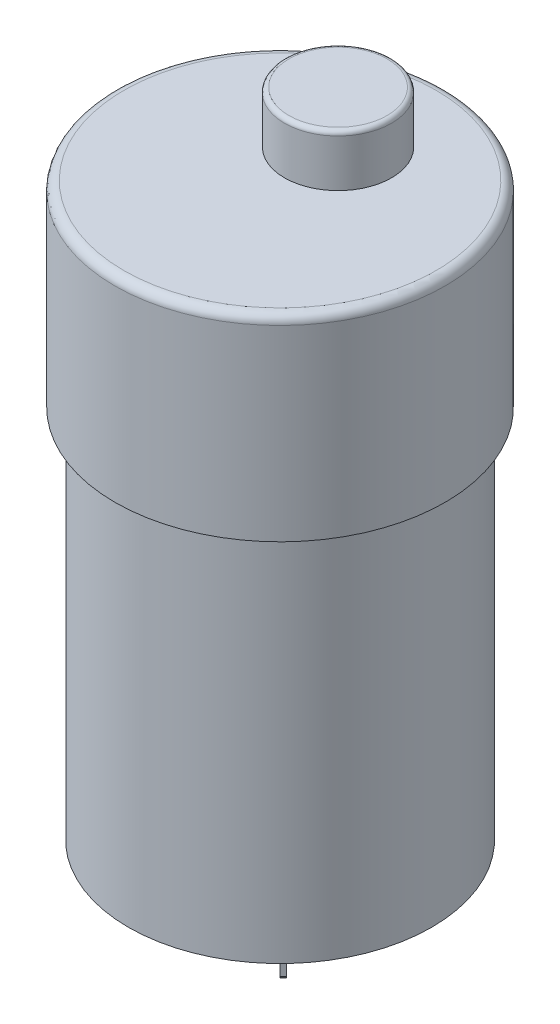
ISO-10303-21;
HEADER;
FILE_DESCRIPTION(('STEP AP214'),'2;1');
FILE_NAME('part.step','',(''),(''),'','','');
FILE_SCHEMA(('AUTOMOTIVE_DESIGN { 1 0 10303 214 1 1 1 1 }'));
ENDSEC;
DATA;
#1=APPLICATION_CONTEXT('core data for automotive mechanical design processes');
#2=APPLICATION_PROTOCOL_DEFINITION('international standard','automotive_design',2000,#1);
#3=PRODUCT_CONTEXT('',#1,'mechanical');
#4=PRODUCT('Part','Part','',(#3));
#5=PRODUCT_RELATED_PRODUCT_CATEGORY('part','',(#4));
#6=PRODUCT_DEFINITION_FORMATION('','',#4);
#7=PRODUCT_DEFINITION_CONTEXT('part definition',#1,'design');
#8=PRODUCT_DEFINITION('design','',#6,#7);
#9=PRODUCT_DEFINITION_SHAPE('','',#8);
#10=(LENGTH_UNIT() NAMED_UNIT(*) SI_UNIT(.MILLI.,.METRE.));
#11=(NAMED_UNIT(*) PLANE_ANGLE_UNIT() SI_UNIT($,.RADIAN.));
#12=(NAMED_UNIT(*) SI_UNIT($,.STERADIAN.) SOLID_ANGLE_UNIT());
#13=UNCERTAINTY_MEASURE_WITH_UNIT(LENGTH_MEASURE(1.E-05),#10,'distance_accuracy_value','');
#14=(GEOMETRIC_REPRESENTATION_CONTEXT(3) GLOBAL_UNCERTAINTY_ASSIGNED_CONTEXT((#13)) GLOBAL_UNIT_ASSIGNED_CONTEXT((#10,
#11,#12)) REPRESENTATION_CONTEXT('',''));
#15=CARTESIAN_POINT('',(0.,0.,0.));
#16=DIRECTION('',(0.,0.,1.));
#17=DIRECTION('',(1.,0.,0.));
#18=AXIS2_PLACEMENT_3D('',#15,#16,#17);
#19=CARTESIAN_POINT('',(0.,-44.5,0.));
#20=DIRECTION('',(0.,-1.,0.));
#21=DIRECTION('',(0.,0.,-1.));
#22=AXIS2_PLACEMENT_3D('',#19,#20,#21);
#23=PLANE('',#22);
#24=CARTESIAN_POINT('',(0.,-44.5000000020173,0.));
#25=DIRECTION('',(0.,1.,0.));
#26=DIRECTION('',(0.,0.,1.));
#27=AXIS2_PLACEMENT_3D('',#24,#25,#26);
#28=CIRCLE('',#27,1.99999999796319);
#29=CARTESIAN_POINT('',(0.,-44.5000000020173,1.99999999796319));
#30=VERTEX_POINT('',#29);
#31=EDGE_CURVE('E195',#30,#30,#28,.T.);
#32=ORIENTED_EDGE('',*,*,#31,.F.);
#33=EDGE_LOOP('',(#32));
#34=FACE_BOUND('',#33,.T.);
#35=ADVANCED_FACE('F15',(#34),#23,.T.);
#36=CARTESIAN_POINT('',(0.,-43.500000002382,0.));
#37=DIRECTION('',(0.,1.,0.));
#38=DIRECTION('',(0.,0.,1.));
#39=AXIS2_PLACEMENT_3D('',#36,#37,#38);
#40=CONICAL_SURFACE('',#39,2.99999999765532,0.78539816342587);
#41=CARTESIAN_POINT('',(0.,-43.5,0.));
#42=DIRECTION('',(0.,-1.,0.));
#43=DIRECTION('',(0.,0.,-1.));
#44=AXIS2_PLACEMENT_3D('',#41,#42,#43);
#45=CIRCLE('',#44,3.);
#46=CARTESIAN_POINT('',(0.,-43.5,-3.));
#47=VERTEX_POINT('',#46);
#48=EDGE_CURVE('E103',#47,#47,#45,.F.);
#49=ORIENTED_EDGE('',*,*,#48,.F.);
#50=EDGE_LOOP('',(#49));
#51=FACE_BOUND('',#50,.T.);
#52=ORIENTED_EDGE('',*,*,#31,.T.);
#53=EDGE_LOOP('',(#52));
#54=FACE_BOUND('',#53,.T.);
#55=ADVANCED_FACE('F636',(#51,#54),#40,.T.);
#56=CARTESIAN_POINT('',(0.,27.8,0.));
#57=DIRECTION('',(0.,1.,0.));
#58=DIRECTION('',(0.,0.,1.));
#59=AXIS2_PLACEMENT_3D('',#56,#57,#58);
#60=PLANE('',#59);
#61=CARTESIAN_POINT('',(0.,27.8,-6.5));
#62=DIRECTION('',(0.,-1.,0.));
#63=DIRECTION('',(1.,0.,0.));
#64=AXIS2_PLACEMENT_3D('',#61,#62,#63);
#65=CIRCLE('',#64,5.5);
#66=CARTESIAN_POINT('',(5.49999999999999,27.8,-6.49999999990358));
#67=VERTEX_POINT('',#66);
#68=CARTESIAN_POINT('',(-5.49999999999999,27.8,-6.50000000019283));
#69=VERTEX_POINT('',#68);
#70=EDGE_CURVE('E96',#67,#69,#65,.T.);
#71=ORIENTED_EDGE('',*,*,#70,.F.);
#72=CARTESIAN_POINT('',(0.,27.8,-6.5));
#73=DIRECTION('',(0.,-1.,0.));
#74=DIRECTION('',(-1.,0.,-8.7651950092022E-11));
#75=AXIS2_PLACEMENT_3D('',#72,#73,#74);
#76=CIRCLE('',#75,5.49999999999999);
#77=EDGE_CURVE('E101',#69,#67,#76,.T.);
#78=ORIENTED_EDGE('',*,*,#77,.F.);
#79=EDGE_LOOP('',(#71,#78));
#80=FACE_BOUND('',#79,.T.);
#81=ADVANCED_FACE('F100',(#80),#60,.T.);
#82=CARTESIAN_POINT('',(0.,-41.,0.));
#83=DIRECTION('',(0.,-1.,0.));
#84=DIRECTION('',(0.,0.,-1.));
#85=AXIS2_PLACEMENT_3D('',#82,#83,#84);
#86=CYLINDRICAL_SURFACE('',#85,3.);
#87=CARTESIAN_POINT('',(0.,-42.,0.));
#88=DIRECTION('',(0.,-1.,0.));
#89=DIRECTION('',(0.,0.,-1.));
#90=AXIS2_PLACEMENT_3D('',#87,#88,#89);
#91=CIRCLE('',#90,3.);
#92=CARTESIAN_POINT('',(0.,-42.,-3.));
#93=VERTEX_POINT('',#92);
#94=EDGE_CURVE('E108',#93,#93,#91,.T.);
#95=ORIENTED_EDGE('',*,*,#94,.T.);
#96=EDGE_LOOP('',(#95));
#97=FACE_BOUND('',#96,.T.);
#98=ORIENTED_EDGE('',*,*,#48,.T.);
#99=EDGE_LOOP('',(#98));
#100=FACE_BOUND('',#99,.T.);
#101=ADVANCED_FACE('F128',(#97,#100),#86,.T.);
#102=CARTESIAN_POINT('',(0.,27.3,-6.5));
#103=DIRECTION('',(0.,1.,0.));
#104=DIRECTION('',(0.99973125882797,0.,0.0231821078041371));
#105=AXIS2_PLACEMENT_3D('',#102,#103,#104);
#106=TOROIDAL_SURFACE('',#105,5.5,0.5);
#107=CARTESIAN_POINT('',(0.,27.3,-6.5));
#108=DIRECTION('',(0.,1.,0.));
#109=DIRECTION('',(0.,0.,1.));
#110=AXIS2_PLACEMENT_3D('',#107,#108,#109);
#111=CIRCLE('',#110,6.);
#112=CARTESIAN_POINT('',(0.,27.3,-0.5));
#113=VERTEX_POINT('',#112);
#114=EDGE_CURVE('E136',#113,#113,#111,.F.);
#115=ORIENTED_EDGE('',*,*,#114,.F.);
#116=EDGE_LOOP('',(#115));
#117=FACE_BOUND('',#116,.T.);
#118=ORIENTED_EDGE('',*,*,#77,.T.);
#119=ORIENTED_EDGE('',*,*,#70,.T.);
#120=EDGE_LOOP('',(#118,#119));
#121=FACE_BOUND('',#120,.T.);
#122=ADVANCED_FACE('F107',(#117,#121),#106,.T.);
#123=CARTESIAN_POINT('',(0.,-42.,0.));
#124=DIRECTION('',(0.,1.,0.));
#125=DIRECTION('',(0.,0.,1.));
#126=AXIS2_PLACEMENT_3D('',#123,#124,#125);
#127=PLANE('',#126);
#128=ORIENTED_EDGE('',*,*,#94,.F.);
#129=EDGE_LOOP('',(#128));
#130=FACE_BOUND('',#129,.T.);
#131=CARTESIAN_POINT('',(0.,-42.,0.));
#132=DIRECTION('',(0.,-1.,0.));
#133=DIRECTION('',(0.,0.,-1.));
#134=AXIS2_PLACEMENT_3D('',#131,#132,#133);
#135=CIRCLE('',#134,5.);
#136=CARTESIAN_POINT('',(0.,-42.,-5.));
#137=VERTEX_POINT('',#136);
#138=EDGE_CURVE('E138',#137,#137,#135,.F.);
#139=ORIENTED_EDGE('',*,*,#138,.F.);
#140=EDGE_LOOP('',(#139));
#141=FACE_BOUND('',#140,.T.);
#142=ADVANCED_FACE('F127',(#130,#141),#127,.F.);
#143=CARTESIAN_POINT('',(9.41866232540481,-41.,-10.1257691065914));
#144=DIRECTION('',(0.707106781186548,0.,-0.707106781186548));
#145=DIRECTION('',(-0.707106781186548,0.,-0.707106781186548));
#146=AXIS2_PLACEMENT_3D('',#143,#144,#145);
#147=PLANE('',#146);
#148=DIRECTION('',(0.,1.,0.));
#149=VECTOR('',#148,1.);
#150=CARTESIAN_POINT('',(9.77221571599809,-41.,-9.77221571599809));
#151=LINE('',#150,#149);
#152=CARTESIAN_POINT('',(9.77221571599809,-45.5,-9.77221571599809));
#153=VERTEX_POINT('',#152);
#154=CARTESIAN_POINT('',(9.77221571599809,-41.,-9.77221571599809));
#155=VERTEX_POINT('',#154);
#156=EDGE_CURVE('E319',#153,#155,#151,.T.);
#157=ORIENTED_EDGE('',*,*,#156,.F.);
#158=DIRECTION('',(0.707106781186554,0.,0.70710678118654));
#159=VECTOR('',#158,1.);
#160=CARTESIAN_POINT('',(9.41866232540481,-45.5,-10.1257691065914));
#161=LINE('',#160,#159);
#162=CARTESIAN_POINT('',(9.41866232540481,-45.5,-10.1257691065914));
#163=VERTEX_POINT('',#162);
#164=EDGE_CURVE('E167',#163,#153,#161,.T.);
#165=ORIENTED_EDGE('',*,*,#164,.F.);
#166=DIRECTION('',(0.,1.,0.));
#167=VECTOR('',#166,1.);
#168=CARTESIAN_POINT('',(9.41866232540481,-41.,-10.1257691065914));
#169=LINE('',#168,#167);
#170=CARTESIAN_POINT('',(9.41866232540481,-41.,-10.1257691065914));
#171=VERTEX_POINT('',#170);
#172=EDGE_CURVE('E325',#171,#163,#169,.F.);
#173=ORIENTED_EDGE('',*,*,#172,.F.);
#174=DIRECTION('',(-0.707106781186548,0.,-0.707106781186548));
#175=VECTOR('',#174,1.);
#176=CARTESIAN_POINT('',(9.41866232540481,-41.,-10.1257691065914));
#177=LINE('',#176,#175);
#178=EDGE_CURVE('E134',#171,#155,#177,.F.);
#179=ORIENTED_EDGE('',*,*,#178,.T.);
#180=EDGE_LOOP('',(#157,#165,#173,#179));
#181=FACE_BOUND('',#180,.T.);
#182=ADVANCED_FACE('F354',(#181),#147,.T.);
#183=CARTESIAN_POINT('',(8.00444876303172,-41.,-8.00444876303172));
#184=DIRECTION('',(-0.707106781186547,0.,0.707106781186548));
#185=DIRECTION('',(0.707106781186548,0.,0.707106781186547));
#186=AXIS2_PLACEMENT_3D('',#183,#184,#185);
#187=PLANE('',#186);
#188=DIRECTION('',(0.,1.,0.));
#189=VECTOR('',#188,1.);
#190=CARTESIAN_POINT('',(7.65089537243844,-41.,-8.35800215362499));
#191=LINE('',#190,#189);
#192=CARTESIAN_POINT('',(7.65089537243844,-45.5,-8.35800215362499));
#193=VERTEX_POINT('',#192);
#194=CARTESIAN_POINT('',(7.65089537243844,-41.,-8.35800215362499));
#195=VERTEX_POINT('',#194);
#196=EDGE_CURVE('E328',#193,#195,#191,.T.);
#197=ORIENTED_EDGE('',*,*,#196,.F.);
#198=DIRECTION('',(-0.707106781186549,0.,-0.707106781186546));
#199=VECTOR('',#198,1.);
#200=CARTESIAN_POINT('',(8.00444876303172,-45.5,-8.00444876303172));
#201=LINE('',#200,#199);
#202=CARTESIAN_POINT('',(8.00444876303172,-45.5,-8.00444876303172));
#203=VERTEX_POINT('',#202);
#204=EDGE_CURVE('E175',#203,#193,#201,.T.);
#205=ORIENTED_EDGE('',*,*,#204,.F.);
#206=DIRECTION('',(0.,1.,0.));
#207=VECTOR('',#206,1.);
#208=CARTESIAN_POINT('',(8.00444876303172,-41.,-8.00444876303172));
#209=LINE('',#208,#207);
#210=CARTESIAN_POINT('',(8.00444876303172,-41.,-8.00444876303172));
#211=VERTEX_POINT('',#210);
#212=EDGE_CURVE('E316',#211,#203,#209,.F.);
#213=ORIENTED_EDGE('',*,*,#212,.F.);
#214=DIRECTION('',(0.707106781186548,0.,0.707106781186547));
#215=VECTOR('',#214,1.);
#216=CARTESIAN_POINT('',(8.00444876303172,-41.,-8.00444876303172));
#217=LINE('',#216,#215);
#218=EDGE_CURVE('E176',#211,#195,#217,.F.);
#219=ORIENTED_EDGE('',*,*,#218,.T.);
#220=EDGE_LOOP('',(#197,#205,#213,#219));
#221=FACE_BOUND('',#220,.T.);
#222=ADVANCED_FACE('F348',(#221),#187,.T.);
#223=CARTESIAN_POINT('',(8.00444876303172,-45.75,-8.35800215362499));
#224=DIRECTION('',(-0.499999999999998,-0.70710678118655,0.499999999999999));
#225=DIRECTION('',(0.,-0.577350269189624,-0.816496580927728));
#226=AXIS2_PLACEMENT_3D('',#223,#224,#225);
#227=PLANE('',#226);
#228=ORIENTED_EDGE('',*,*,#204,.T.);
#229=DIRECTION('',(-0.499999999999999,0.707106781186548,0.5));
#230=VECTOR('',#229,1.);
#231=CARTESIAN_POINT('',(8.00444876303172,-46.,-8.71155554421827));
#232=LINE('',#231,#230);
#233=CARTESIAN_POINT('',(8.00444876303172,-46.,-8.71155554421827));
#234=VERTEX_POINT('',#233);
#235=EDGE_CURVE('E329',#234,#193,#232,.T.);
#236=ORIENTED_EDGE('',*,*,#235,.F.);
#237=DIRECTION('',(-0.707106781186546,0.,-0.707106781186549));
#238=VECTOR('',#237,1.);
#239=CARTESIAN_POINT('',(8.35800215362499,-46.,-8.35800215362499));
#240=LINE('',#239,#238);
#241=CARTESIAN_POINT('',(8.35800215362499,-46.,-8.35800215362499));
#242=VERTEX_POINT('',#241);
#243=EDGE_CURVE('E173',#242,#234,#240,.T.);
#244=ORIENTED_EDGE('',*,*,#243,.F.);
#245=DIRECTION('',(0.499999999999999,-0.707106781186549,-0.499999999999999));
#246=VECTOR('',#245,1.);
#247=CARTESIAN_POINT('',(8.00444876303172,-45.5,-8.00444876303172));
#248=LINE('',#247,#246);
#249=EDGE_CURVE('E313',#203,#242,#248,.T.);
#250=ORIENTED_EDGE('',*,*,#249,.F.);
#251=EDGE_LOOP('',(#228,#236,#244,#250));
#252=FACE_BOUND('',#251,.T.);
#253=ADVANCED_FACE('F347',(#252),#227,.T.);
#254=CARTESIAN_POINT('',(0.,-46.,0.));
#255=DIRECTION('',(0.,-1.,0.));
#256=DIRECTION('',(0.,0.,-1.));
#257=AXIS2_PLACEMENT_3D('',#254,#255,#256);
#258=PLANE('',#257);
#259=DIRECTION('',(-0.707106781186548,0.,0.707106781186547));
#260=VECTOR('',#259,1.);
#261=CARTESIAN_POINT('',(7.65089537243844,-46.,-8.35800215362499));
#262=LINE('',#261,#260);
#263=CARTESIAN_POINT('',(9.06510893481154,-46.,-9.77221571599809));
#264=VERTEX_POINT('',#263);
#265=EDGE_CURVE('E143',#264,#234,#262,.T.);
#266=ORIENTED_EDGE('',*,*,#265,.F.);
#267=DIRECTION('',(-0.707106781186546,0.,-0.707106781186549));
#268=VECTOR('',#267,1.);
#269=CARTESIAN_POINT('',(9.41866232540481,-46.,-9.41866232540481));
#270=LINE('',#269,#268);
#271=CARTESIAN_POINT('',(9.41866232540481,-46.,-9.41866232540481));
#272=VERTEX_POINT('',#271);
#273=EDGE_CURVE('E170',#272,#264,#270,.T.);
#274=ORIENTED_EDGE('',*,*,#273,.F.);
#275=DIRECTION('',(0.707106781186548,0.,-0.707106781186548));
#276=VECTOR('',#275,1.);
#277=CARTESIAN_POINT('',(9.77221571599809,-46.,-9.77221571599809));
#278=LINE('',#277,#276);
#279=EDGE_CURVE('E310',#242,#272,#278,.T.);
#280=ORIENTED_EDGE('',*,*,#279,.F.);
#281=ORIENTED_EDGE('',*,*,#243,.T.);
#282=EDGE_LOOP('',(#266,#274,#280,#281));
#283=FACE_BOUND('',#282,.T.);
#284=ADVANCED_FACE('F337',(#283),#258,.T.);
#285=CARTESIAN_POINT('',(9.41866232540484,-45.75,-9.77221571599806));
#286=DIRECTION('',(0.499999999999998,-0.70710678118655,-0.499999999999998));
#287=DIRECTION('',(0.,0.577350269189623,-0.816496580927728));
#288=AXIS2_PLACEMENT_3D('',#285,#286,#287);
#289=PLANE('',#288);
#290=ORIENTED_EDGE('',*,*,#164,.T.);
#291=DIRECTION('',(0.499999999999999,0.707106781186549,-0.499999999999999));
#292=VECTOR('',#291,1.);
#293=CARTESIAN_POINT('',(9.41866232540481,-46.,-9.41866232540482));
#294=LINE('',#293,#292);
#295=EDGE_CURVE('E307',#272,#153,#294,.T.);
#296=ORIENTED_EDGE('',*,*,#295,.F.);
#297=ORIENTED_EDGE('',*,*,#273,.T.);
#298=DIRECTION('',(-0.5,-0.707106781186546,0.500000000000002));
#299=VECTOR('',#298,1.);
#300=CARTESIAN_POINT('',(9.41866232540481,-45.5,-10.1257691065914));
#301=LINE('',#300,#299);
#302=EDGE_CURVE('E322',#163,#264,#301,.T.);
#303=ORIENTED_EDGE('',*,*,#302,.F.);
#304=EDGE_LOOP('',(#290,#296,#297,#303));
#305=FACE_BOUND('',#304,.T.);
#306=ADVANCED_FACE('F341',(#305),#289,.T.);
#307=CARTESIAN_POINT('',(8.53477884892163,-45.,-9.24188563010818));
#308=DIRECTION('',(-0.707106781186547,0.,-0.707106781186548));
#309=DIRECTION('',(-0.707106781186548,0.,0.707106781186547));
#310=AXIS2_PLACEMENT_3D('',#307,#308,#309);
#311=CYLINDRICAL_SURFACE('',#310,0.5);
#312=CARTESIAN_POINT('',(8.53477884892163,-45.,-9.24188563010818));
#313=DIRECTION('',(-0.707106781186547,0.,-0.707106781186548));
#314=DIRECTION('',(-0.707106781186548,0.,0.707106781186547));
#315=AXIS2_PLACEMENT_3D('',#312,#313,#314);
#316=CIRCLE('',#315,0.5);
#317=CARTESIAN_POINT('',(8.18122545832835,-45.,-8.8883322395149));
#318=VERTEX_POINT('',#317);
#319=EDGE_CURVE('E321',#318,#318,#316,.F.);
#320=ORIENTED_EDGE('',*,*,#319,.F.);
#321=EDGE_LOOP('',(#320));
#322=FACE_BOUND('',#321,.T.);
#323=CARTESIAN_POINT('',(8.88833223951491,-45.,-8.8883322395149));
#324=DIRECTION('',(-0.707106781186547,0.,-0.707106781186548));
#325=DIRECTION('',(-0.707106781186548,0.,0.707106781186547));
#326=AXIS2_PLACEMENT_3D('',#323,#324,#325);
#327=CIRCLE('',#326,0.5);
#328=CARTESIAN_POINT('',(8.53477884892163,-45.,-8.53477884892163));
#329=VERTEX_POINT('',#328);
#330=EDGE_CURVE('E306',#329,#329,#327,.T.);
#331=ORIENTED_EDGE('',*,*,#330,.F.);
#332=EDGE_LOOP('',(#331));
#333=FACE_BOUND('',#332,.T.);
#334=ADVANCED_FACE('F394',(#322,#333),#311,.F.);
#335=CARTESIAN_POINT('',(0.,-46.,0.));
#336=DIRECTION('',(0.,-1.,0.));
#337=DIRECTION('',(0.,0.,-1.));
#338=AXIS2_PLACEMENT_3D('',#335,#336,#337);
#339=PLANE('',#338);
#340=DIRECTION('',(0.707106781186548,0.,0.707106781186547));
#341=VECTOR('',#340,1.);
#342=CARTESIAN_POINT('',(9.77221571599809,-46.,9.77221571599809));
#343=LINE('',#342,#341);
#344=CARTESIAN_POINT('',(8.35800215362499,-46.,8.35800215362499));
#345=VERTEX_POINT('',#344);
#346=CARTESIAN_POINT('',(9.41866232540482,-46.,9.41866232540482));
#347=VERTEX_POINT('',#346);
#348=EDGE_CURVE('E288',#345,#347,#343,.T.);
#349=ORIENTED_EDGE('',*,*,#348,.F.);
#350=DIRECTION('',(-0.707106781186549,0.,0.707106781186546));
#351=VECTOR('',#350,1.);
#352=CARTESIAN_POINT('',(8.71155554421827,-46.,8.00444876303172));
#353=LINE('',#352,#351);
#354=CARTESIAN_POINT('',(8.71155554421827,-46.,8.00444876303172));
#355=VERTEX_POINT('',#354);
#356=EDGE_CURVE('E146',#355,#345,#353,.T.);
#357=ORIENTED_EDGE('',*,*,#356,.F.);
#358=DIRECTION('',(-0.707106781186548,0.,-0.707106781186547));
#359=VECTOR('',#358,1.);
#360=CARTESIAN_POINT('',(8.35800215362499,-46.,7.65089537243844));
#361=LINE('',#360,#359);
#362=CARTESIAN_POINT('',(9.77221571599809,-46.,9.06510893481154));
#363=VERTEX_POINT('',#362);
#364=EDGE_CURVE('E294',#363,#355,#361,.T.);
#365=ORIENTED_EDGE('',*,*,#364,.F.);
#366=DIRECTION('',(0.707106781186546,0.,-0.707106781186549));
#367=VECTOR('',#366,1.);
#368=CARTESIAN_POINT('',(9.41866232540481,-46.,9.41866232540481));
#369=LINE('',#368,#367);
#370=EDGE_CURVE('E165',#347,#363,#369,.T.);
#371=ORIENTED_EDGE('',*,*,#370,.F.);
#372=EDGE_LOOP('',(#349,#357,#365,#371));
#373=FACE_BOUND('',#372,.T.);
#374=ADVANCED_FACE('F383',(#373),#339,.T.);
#375=CARTESIAN_POINT('',(9.7722157159981,-45.75,9.41866232540481));
#376=DIRECTION('',(0.499999999999993,-0.707106781186558,0.499999999999993));
#377=DIRECTION('',(0.,-0.577350269189615,-0.816496580927734));
#378=AXIS2_PLACEMENT_3D('',#375,#376,#377);
#379=PLANE('',#378);
#380=DIRECTION('',(0.707106781186548,0.,-0.707106781186548));
#381=VECTOR('',#380,1.);
#382=CARTESIAN_POINT('',(10.1257691065914,-45.5,9.41866232540482));
#383=LINE('',#382,#381);
#384=CARTESIAN_POINT('',(9.77221571599809,-45.5,9.77221571599809));
#385=VERTEX_POINT('',#384);
#386=CARTESIAN_POINT('',(10.1257691065914,-45.5,9.41866232540482));
#387=VERTEX_POINT('',#386);
#388=EDGE_CURVE('E160',#385,#387,#383,.T.);
#389=ORIENTED_EDGE('',*,*,#388,.F.);
#390=DIRECTION('',(0.499999999999999,0.707106781186549,0.499999999999999));
#391=VECTOR('',#390,1.);
#392=CARTESIAN_POINT('',(9.41866232540482,-46.,9.41866232540482));
#393=LINE('',#392,#391);
#394=EDGE_CURVE('E285',#347,#385,#393,.T.);
#395=ORIENTED_EDGE('',*,*,#394,.F.);
#396=ORIENTED_EDGE('',*,*,#370,.T.);
#397=DIRECTION('',(-0.500000000000001,-0.707106781186548,-0.499999999999998));
#398=VECTOR('',#397,1.);
#399=CARTESIAN_POINT('',(10.1257691065914,-45.5,9.41866232540482));
#400=LINE('',#399,#398);
#401=EDGE_CURVE('E297',#387,#363,#400,.T.);
#402=ORIENTED_EDGE('',*,*,#401,.F.);
#403=EDGE_LOOP('',(#389,#395,#396,#402));
#404=FACE_BOUND('',#403,.T.);
#405=ADVANCED_FACE('F385',(#404),#379,.T.);
#406=CARTESIAN_POINT('',(10.1257691065914,-41.,9.41866232540482));
#407=DIRECTION('',(0.707106781186548,0.,0.707106781186548));
#408=DIRECTION('',(0.707106781186548,0.,-0.707106781186548));
#409=AXIS2_PLACEMENT_3D('',#406,#407,#408);
#410=PLANE('',#409);
#411=DIRECTION('',(0.,1.,0.));
#412=VECTOR('',#411,1.);
#413=CARTESIAN_POINT('',(9.77221571599809,-41.,9.77221571599809));
#414=LINE('',#413,#412);
#415=CARTESIAN_POINT('',(9.77221571599809,-41.,9.77221571599809));
#416=VERTEX_POINT('',#415);
#417=EDGE_CURVE('E282',#385,#416,#414,.T.);
#418=ORIENTED_EDGE('',*,*,#417,.F.);
#419=ORIENTED_EDGE('',*,*,#388,.T.);
#420=DIRECTION('',(0.,1.,0.));
#421=VECTOR('',#420,1.);
#422=CARTESIAN_POINT('',(10.1257691065914,-41.,9.41866232540482));
#423=LINE('',#422,#421);
#424=CARTESIAN_POINT('',(10.1257691065914,-41.,9.41866232540482));
#425=VERTEX_POINT('',#424);
#426=EDGE_CURVE('E300',#425,#387,#423,.F.);
#427=ORIENTED_EDGE('',*,*,#426,.F.);
#428=DIRECTION('',(0.707106781186548,0.,-0.707106781186548));
#429=VECTOR('',#428,1.);
#430=CARTESIAN_POINT('',(10.1257691065914,-41.,9.41866232540482));
#431=LINE('',#430,#429);
#432=EDGE_CURVE('E162',#425,#416,#431,.F.);
#433=ORIENTED_EDGE('',*,*,#432,.T.);
#434=EDGE_LOOP('',(#418,#419,#427,#433));
#435=FACE_BOUND('',#434,.T.);
#436=ADVANCED_FACE('F375',(#435),#410,.T.);
#437=CARTESIAN_POINT('',(8.00444876303172,-41.,8.00444876303172));
#438=DIRECTION('',(-0.707106781186548,0.,-0.707106781186547));
#439=DIRECTION('',(-0.707106781186547,0.,0.707106781186548));
#440=AXIS2_PLACEMENT_3D('',#437,#438,#439);
#441=PLANE('',#440);
#442=DIRECTION('',(0.,1.,0.));
#443=VECTOR('',#442,1.);
#444=CARTESIAN_POINT('',(8.35800215362499,-41.,7.65089537243844));
#445=LINE('',#444,#443);
#446=CARTESIAN_POINT('',(8.35800215362499,-45.5,7.65089537243844));
#447=VERTEX_POINT('',#446);
#448=CARTESIAN_POINT('',(8.35800215362499,-41.,7.65089537243844));
#449=VERTEX_POINT('',#448);
#450=EDGE_CURVE('E303',#447,#449,#445,.T.);
#451=ORIENTED_EDGE('',*,*,#450,.F.);
#452=DIRECTION('',(0.707106781186534,0.,-0.707106781186561));
#453=VECTOR('',#452,1.);
#454=CARTESIAN_POINT('',(8.00444876303172,-45.5,8.00444876303172));
#455=LINE('',#454,#453);
#456=CARTESIAN_POINT('',(8.00444876303172,-45.5,8.00444876303172));
#457=VERTEX_POINT('',#456);
#458=EDGE_CURVE('E139',#457,#447,#455,.T.);
#459=ORIENTED_EDGE('',*,*,#458,.F.);
#460=DIRECTION('',(0.,1.,0.));
#461=VECTOR('',#460,1.);
#462=CARTESIAN_POINT('',(8.00444876303172,-41.,8.00444876303172));
#463=LINE('',#462,#461);
#464=CARTESIAN_POINT('',(8.00444876303172,-41.,8.00444876303172));
#465=VERTEX_POINT('',#464);
#466=EDGE_CURVE('E279',#465,#457,#463,.F.);
#467=ORIENTED_EDGE('',*,*,#466,.F.);
#468=DIRECTION('',(-0.707106781186547,0.,0.707106781186548));
#469=VECTOR('',#468,1.);
#470=CARTESIAN_POINT('',(8.00444876303172,-41.,8.00444876303172));
#471=LINE('',#470,#469);
#472=EDGE_CURVE('E153',#465,#449,#471,.F.);
#473=ORIENTED_EDGE('',*,*,#472,.T.);
#474=EDGE_LOOP('',(#451,#459,#467,#473));
#475=FACE_BOUND('',#474,.T.);
#476=ADVANCED_FACE('F370',(#475),#441,.T.);
#477=CARTESIAN_POINT('',(8.358002153625,-45.75,8.00444876303171));
#478=DIRECTION('',(-0.500000000000001,-0.707106781186547,-0.5));
#479=DIRECTION('',(0.816496580927725,-0.577350269189627,0.));
#480=AXIS2_PLACEMENT_3D('',#477,#478,#479);
#481=PLANE('',#480);
#482=ORIENTED_EDGE('',*,*,#458,.T.);
#483=DIRECTION('',(-0.5,0.707106781186547,-0.5));
#484=VECTOR('',#483,1.);
#485=CARTESIAN_POINT('',(8.71155554421827,-46.,8.00444876303172));
#486=LINE('',#485,#484);
#487=EDGE_CURVE('E292',#355,#447,#486,.T.);
#488=ORIENTED_EDGE('',*,*,#487,.F.);
#489=ORIENTED_EDGE('',*,*,#356,.T.);
#490=DIRECTION('',(0.499999999999996,-0.707106781186552,0.499999999999996));
#491=VECTOR('',#490,1.);
#492=CARTESIAN_POINT('',(8.00444876303172,-45.5,8.00444876303172));
#493=LINE('',#492,#491);
#494=EDGE_CURVE('E270',#457,#345,#493,.T.);
#495=ORIENTED_EDGE('',*,*,#494,.F.);
#496=EDGE_LOOP('',(#482,#488,#489,#495));
#497=FACE_BOUND('',#496,.T.);
#498=ADVANCED_FACE('F381',(#497),#481,.T.);
#499=CARTESIAN_POINT('',(8.88833223951491,-45.,8.8883322395149));
#500=DIRECTION('',(-0.707106781186547,0.,0.707106781186548));
#501=DIRECTION('',(0.707106781186548,0.,0.707106781186547));
#502=AXIS2_PLACEMENT_3D('',#499,#500,#501);
#503=CYLINDRICAL_SURFACE('',#502,0.5);
#504=CARTESIAN_POINT('',(9.24188563010818,-45.,8.53477884892163));
#505=DIRECTION('',(-0.707106781186547,0.,0.707106781186548));
#506=DIRECTION('',(0.707106781186548,0.,0.707106781186547));
#507=AXIS2_PLACEMENT_3D('',#504,#505,#506);
#508=CIRCLE('',#507,0.5);
#509=CARTESIAN_POINT('',(9.59543902070145,-45.,8.88833223951491));
#510=VERTEX_POINT('',#509);
#511=EDGE_CURVE('E291',#510,#510,#508,.T.);
#512=ORIENTED_EDGE('',*,*,#511,.F.);
#513=EDGE_LOOP('',(#512));
#514=FACE_BOUND('',#513,.T.);
#515=CARTESIAN_POINT('',(8.8883322395149,-45.,8.88833223951491));
#516=DIRECTION('',(-0.707106781186547,0.,0.707106781186548));
#517=DIRECTION('',(0.707106781186548,0.,0.707106781186547));
#518=AXIS2_PLACEMENT_3D('',#515,#516,#517);
#519=CIRCLE('',#518,0.5);
#520=CARTESIAN_POINT('',(9.24188563010818,-45.,9.24188563010818));
#521=VERTEX_POINT('',#520);
#522=EDGE_CURVE('E278',#521,#521,#519,.F.);
#523=ORIENTED_EDGE('',*,*,#522,.F.);
#524=EDGE_LOOP('',(#523));
#525=FACE_BOUND('',#524,.T.);
#526=ADVANCED_FACE('F467',(#514,#525),#503,.F.);
#527=CARTESIAN_POINT('',(0.,22.,-6.5));
#528=DIRECTION('',(0.,1.,0.));
#529=DIRECTION('',(0.,0.,1.));
#530=AXIS2_PLACEMENT_3D('',#527,#528,#529);
#531=CYLINDRICAL_SURFACE('',#530,6.);
#532=CARTESIAN_POINT('',(0.,22.,-6.5));
#533=DIRECTION('',(0.,1.,0.));
#534=DIRECTION('',(0.,0.,1.));
#535=AXIS2_PLACEMENT_3D('',#532,#533,#534);
#536=CIRCLE('',#535,6.);
#537=CARTESIAN_POINT('',(0.,22.,-0.5));
#538=VERTEX_POINT('',#537);
#539=EDGE_CURVE('E434',#538,#538,#536,.F.);
#540=ORIENTED_EDGE('',*,*,#539,.F.);
#541=EDGE_LOOP('',(#540));
#542=FACE_BOUND('',#541,.T.);
#543=ORIENTED_EDGE('',*,*,#114,.T.);
#544=EDGE_LOOP('',(#543));
#545=FACE_BOUND('',#544,.T.);
#546=ADVANCED_FACE('F463',(#542,#545),#531,.T.);
#547=CARTESIAN_POINT('',(0.,-42.,0.));
#548=DIRECTION('',(0.,-1.,0.));
#549=DIRECTION('',(0.,0.,-1.));
#550=AXIS2_PLACEMENT_3D('',#547,#548,#549);
#551=CYLINDRICAL_SURFACE('',#550,5.);
#552=CARTESIAN_POINT('',(0.,-41.,0.));
#553=DIRECTION('',(0.,-1.,0.));
#554=DIRECTION('',(0.,0.,-1.));
#555=AXIS2_PLACEMENT_3D('',#552,#553,#554);
#556=CIRCLE('',#555,5.);
#557=CARTESIAN_POINT('',(0.,-41.,-5.));
#558=VERTEX_POINT('',#557);
#559=EDGE_CURVE('E238',#558,#558,#556,.F.);
#560=ORIENTED_EDGE('',*,*,#559,.F.);
#561=EDGE_LOOP('',(#560));
#562=FACE_BOUND('',#561,.T.);
#563=ORIENTED_EDGE('',*,*,#138,.T.);
#564=EDGE_LOOP('',(#563));
#565=FACE_BOUND('',#564,.T.);
#566=ADVANCED_FACE('F458',(#562,#565),#551,.T.);
#567=CARTESIAN_POINT('',(7.65089537243844,-41.,-8.35800215362499));
#568=DIRECTION('',(-0.707106781186547,0.,-0.707106781186548));
#569=DIRECTION('',(-0.707106781186548,0.,0.707106781186547));
#570=AXIS2_PLACEMENT_3D('',#567,#568,#569);
#571=PLANE('',#570);
#572=ORIENTED_EDGE('',*,*,#319,.T.);
#573=EDGE_LOOP('',(#572));
#574=FACE_BOUND('',#573,.T.);
#575=ORIENTED_EDGE('',*,*,#172,.T.);
#576=ORIENTED_EDGE('',*,*,#302,.T.);
#577=ORIENTED_EDGE('',*,*,#265,.T.);
#578=ORIENTED_EDGE('',*,*,#235,.T.);
#579=ORIENTED_EDGE('',*,*,#196,.T.);
#580=DIRECTION('',(-0.707106781186548,0.,0.707106781186547));
#581=VECTOR('',#580,1.);
#582=CARTESIAN_POINT('',(9.41866232540481,-41.,-10.1257691065914));
#583=LINE('',#582,#581);
#584=EDGE_CURVE('E235',#171,#195,#583,.T.);
#585=ORIENTED_EDGE('',*,*,#584,.F.);
#586=EDGE_LOOP('',(#575,#576,#577,#578,#579,#585));
#587=FACE_BOUND('',#586,.T.);
#588=ADVANCED_FACE('F334',(#574,#587),#571,.T.);
#589=CARTESIAN_POINT('',(9.77221571599809,-41.,-9.77221571599809));
#590=DIRECTION('',(0.707106781186548,0.,0.707106781186548));
#591=DIRECTION('',(0.707106781186548,0.,-0.707106781186548));
#592=AXIS2_PLACEMENT_3D('',#589,#590,#591);
#593=PLANE('',#592);
#594=ORIENTED_EDGE('',*,*,#330,.T.);
#595=EDGE_LOOP('',(#594));
#596=FACE_BOUND('',#595,.T.);
#597=ORIENTED_EDGE('',*,*,#279,.T.);
#598=ORIENTED_EDGE('',*,*,#295,.T.);
#599=ORIENTED_EDGE('',*,*,#156,.T.);
#600=DIRECTION('',(0.707106781186547,0.,-0.707106781186547));
#601=VECTOR('',#600,1.);
#602=CARTESIAN_POINT('',(8.00444876303172,-41.,-8.00444876303172));
#603=LINE('',#602,#601);
#604=EDGE_CURVE('E232',#211,#155,#603,.T.);
#605=ORIENTED_EDGE('',*,*,#604,.F.);
#606=ORIENTED_EDGE('',*,*,#212,.T.);
#607=ORIENTED_EDGE('',*,*,#249,.T.);
#608=EDGE_LOOP('',(#597,#598,#599,#605,#606,#607));
#609=FACE_BOUND('',#608,.T.);
#610=ADVANCED_FACE('F343',(#596,#609),#593,.T.);
#611=CARTESIAN_POINT('',(8.35800215362499,-41.,7.65089537243844));
#612=DIRECTION('',(0.707106781186547,0.,-0.707106781186548));
#613=DIRECTION('',(-0.707106781186548,0.,-0.707106781186547));
#614=AXIS2_PLACEMENT_3D('',#611,#612,#613);
#615=PLANE('',#614);
#616=ORIENTED_EDGE('',*,*,#511,.T.);
#617=EDGE_LOOP('',(#616));
#618=FACE_BOUND('',#617,.T.);
#619=ORIENTED_EDGE('',*,*,#364,.T.);
#620=ORIENTED_EDGE('',*,*,#487,.T.);
#621=ORIENTED_EDGE('',*,*,#450,.T.);
#622=DIRECTION('',(-0.707106781186548,0.,-0.707106781186547));
#623=VECTOR('',#622,1.);
#624=CARTESIAN_POINT('',(10.1257691065914,-41.,9.41866232540482));
#625=LINE('',#624,#623);
#626=EDGE_CURVE('E229',#425,#449,#625,.T.);
#627=ORIENTED_EDGE('',*,*,#626,.F.);
#628=ORIENTED_EDGE('',*,*,#426,.T.);
#629=ORIENTED_EDGE('',*,*,#401,.T.);
#630=EDGE_LOOP('',(#619,#620,#621,#627,#628,#629));
#631=FACE_BOUND('',#630,.T.);
#632=ADVANCED_FACE('F379',(#618,#631),#615,.T.);
#633=CARTESIAN_POINT('',(9.77221571599809,-41.,9.77221571599809));
#634=DIRECTION('',(-0.707106781186547,0.,0.707106781186548));
#635=DIRECTION('',(0.707106781186548,0.,0.707106781186547));
#636=AXIS2_PLACEMENT_3D('',#633,#634,#635);
#637=PLANE('',#636);
#638=ORIENTED_EDGE('',*,*,#522,.T.);
#639=EDGE_LOOP('',(#638));
#640=FACE_BOUND('',#639,.T.);
#641=ORIENTED_EDGE('',*,*,#466,.T.);
#642=ORIENTED_EDGE('',*,*,#494,.T.);
#643=ORIENTED_EDGE('',*,*,#348,.T.);
#644=ORIENTED_EDGE('',*,*,#394,.T.);
#645=ORIENTED_EDGE('',*,*,#417,.T.);
#646=DIRECTION('',(0.707106781186548,0.,0.707106781186547));
#647=VECTOR('',#646,1.);
#648=CARTESIAN_POINT('',(8.00444876303172,-41.,8.00444876303172));
#649=LINE('',#648,#647);
#650=EDGE_CURVE('E226',#465,#416,#649,.T.);
#651=ORIENTED_EDGE('',*,*,#650,.F.);
#652=EDGE_LOOP('',(#641,#642,#643,#644,#645,#651));
#653=FACE_BOUND('',#652,.T.);
#654=ADVANCED_FACE('F254',(#640,#653),#637,.T.);
#655=CARTESIAN_POINT('',(0.,22.,0.));
#656=DIRECTION('',(0.,1.,0.));
#657=DIRECTION('',(0.,0.,1.));
#658=AXIS2_PLACEMENT_3D('',#655,#656,#657);
#659=PLANE('',#658);
#660=ORIENTED_EDGE('',*,*,#539,.T.);
#661=EDGE_LOOP('',(#660));
#662=FACE_BOUND('',#661,.T.);
#663=CARTESIAN_POINT('',(0.,22.,0.));
#664=DIRECTION('',(0.,-1.,0.));
#665=DIRECTION('',(0.,0.,-1.));
#666=AXIS2_PLACEMENT_3D('',#663,#664,#665);
#667=CIRCLE('',#666,17.5);
#668=CARTESIAN_POINT('',(4.08522690624815E-13,22.,-17.5));
#669=VERTEX_POINT('',#668);
#670=CARTESIAN_POINT('',(-8.12224636506653E-13,22.,17.5));
#671=VERTEX_POINT('',#670);
#672=EDGE_CURVE('E34',#669,#671,#667,.T.);
#673=ORIENTED_EDGE('',*,*,#672,.F.);
#674=CARTESIAN_POINT('',(0.,22.,0.));
#675=DIRECTION('',(0.,-1.,0.));
#676=DIRECTION('',(-1.16152127598619E-13,0.,1.));
#677=AXIS2_PLACEMENT_3D('',#674,#675,#676);
#678=CIRCLE('',#677,17.5);
#679=EDGE_CURVE('E266',#671,#669,#678,.T.);
#680=ORIENTED_EDGE('',*,*,#679,.F.);
#681=EDGE_LOOP('',(#673,#680));
#682=FACE_BOUND('',#681,.T.);
#683=ADVANCED_FACE('F245',(#662,#682),#659,.T.);
#684=CARTESIAN_POINT('',(0.,-41.,0.));
#685=DIRECTION('',(0.,-1.,0.));
#686=DIRECTION('',(0.,0.,-1.));
#687=AXIS2_PLACEMENT_3D('',#684,#685,#686);
#688=PLANE('',#687);
#689=ORIENTED_EDGE('',*,*,#472,.F.);
#690=ORIENTED_EDGE('',*,*,#650,.T.);
#691=ORIENTED_EDGE('',*,*,#432,.F.);
#692=ORIENTED_EDGE('',*,*,#626,.T.);
#693=EDGE_LOOP('',(#689,#690,#691,#692));
#694=FACE_BOUND('',#693,.T.);
#695=ORIENTED_EDGE('',*,*,#218,.F.);
#696=ORIENTED_EDGE('',*,*,#604,.T.);
#697=ORIENTED_EDGE('',*,*,#178,.F.);
#698=ORIENTED_EDGE('',*,*,#584,.T.);
#699=EDGE_LOOP('',(#695,#696,#697,#698));
#700=FACE_BOUND('',#699,.T.);
#701=ORIENTED_EDGE('',*,*,#559,.T.);
#702=EDGE_LOOP('',(#701));
#703=FACE_BOUND('',#702,.T.);
#704=CARTESIAN_POINT('',(0.,-41.,0.));
#705=DIRECTION('',(0.,-1.,0.));
#706=DIRECTION('',(0.,0.,-1.));
#707=AXIS2_PLACEMENT_3D('',#704,#705,#706);
#708=CIRCLE('',#707,16.5);
#709=CARTESIAN_POINT('',(0.,-41.,-16.5));
#710=VERTEX_POINT('',#709);
#711=EDGE_CURVE('E225',#710,#710,#708,.T.);
#712=ORIENTED_EDGE('',*,*,#711,.T.);
#713=EDGE_LOOP('',(#712));
#714=FACE_BOUND('',#713,.T.);
#715=ADVANCED_FACE('F213',(#694,#700,#703,#714),#688,.T.);
#716=CARTESIAN_POINT('',(0.,21.,0.));
#717=DIRECTION('',(0.,1.,0.));
#718=DIRECTION('',(0.00751912418094471,0.,-0.999971730986207));
#719=AXIS2_PLACEMENT_3D('',#716,#717,#718);
#720=TOROIDAL_SURFACE('',#719,17.5,1.);
#721=CARTESIAN_POINT('',(0.,21.,0.));
#722=DIRECTION('',(0.,1.,0.));
#723=DIRECTION('',(0.,0.,1.));
#724=AXIS2_PLACEMENT_3D('',#721,#722,#723);
#725=CIRCLE('',#724,18.5);
#726=CARTESIAN_POINT('',(0.,21.,18.5));
#727=VERTEX_POINT('',#726);
#728=EDGE_CURVE('E221',#727,#727,#725,.F.);
#729=ORIENTED_EDGE('',*,*,#728,.F.);
#730=EDGE_LOOP('',(#729));
#731=FACE_BOUND('',#730,.T.);
#732=ORIENTED_EDGE('',*,*,#679,.T.);
#733=ORIENTED_EDGE('',*,*,#672,.T.);
#734=EDGE_LOOP('',(#732,#733));
#735=FACE_BOUND('',#734,.T.);
#736=ADVANCED_FACE('F201',(#731,#735),#720,.T.);
#737=CARTESIAN_POINT('',(0.,-42.,0.));
#738=DIRECTION('',(0.,-1.,0.));
#739=DIRECTION('',(0.,0.,-1.));
#740=AXIS2_PLACEMENT_3D('',#737,#738,#739);
#741=CYLINDRICAL_SURFACE('',#740,16.5);
#742=CARTESIAN_POINT('',(0.,-42.,0.));
#743=DIRECTION('',(0.,-1.,0.));
#744=DIRECTION('',(0.,0.,-1.));
#745=AXIS2_PLACEMENT_3D('',#742,#743,#744);
#746=CIRCLE('',#745,16.5);
#747=CARTESIAN_POINT('',(0.,-42.,-16.5));
#748=VERTEX_POINT('',#747);
#749=EDGE_CURVE('E224',#748,#748,#746,.T.);
#750=ORIENTED_EDGE('',*,*,#749,.T.);
#751=EDGE_LOOP('',(#750));
#752=FACE_BOUND('',#751,.T.);
#753=ORIENTED_EDGE('',*,*,#711,.F.);
#754=EDGE_LOOP('',(#753));
#755=FACE_BOUND('',#754,.T.);
#756=ADVANCED_FACE('F212',(#752,#755),#741,.F.);
#757=CARTESIAN_POINT('',(0.,0.,0.));
#758=DIRECTION('',(0.,1.,0.));
#759=DIRECTION('',(0.,0.,1.));
#760=AXIS2_PLACEMENT_3D('',#757,#758,#759);
#761=CYLINDRICAL_SURFACE('',#760,18.5);
#762=CARTESIAN_POINT('',(0.,0.,0.));
#763=DIRECTION('',(0.,1.,0.));
#764=DIRECTION('',(0.,0.,1.));
#765=AXIS2_PLACEMENT_3D('',#762,#763,#764);
#766=CIRCLE('',#765,18.5);
#767=CARTESIAN_POINT('',(0.,0.,18.5));
#768=VERTEX_POINT('',#767);
#769=EDGE_CURVE('E422',#768,#768,#766,.T.);
#770=ORIENTED_EDGE('',*,*,#769,.T.);
#771=EDGE_LOOP('',(#770));
#772=FACE_BOUND('',#771,.T.);
#773=ORIENTED_EDGE('',*,*,#728,.T.);
#774=EDGE_LOOP('',(#773));
#775=FACE_BOUND('',#774,.T.);
#776=ADVANCED_FACE('F411',(#772,#775),#761,.T.);
#777=CARTESIAN_POINT('',(0.,-42.,0.));
#778=DIRECTION('',(0.,1.,0.));
#779=DIRECTION('',(0.,0.,1.));
#780=AXIS2_PLACEMENT_3D('',#777,#778,#779);
#781=PLANE('',#780);
#782=ORIENTED_EDGE('',*,*,#749,.F.);
#783=EDGE_LOOP('',(#782));
#784=FACE_BOUND('',#783,.T.);
#785=CARTESIAN_POINT('',(0.,-42.,0.));
#786=DIRECTION('',(0.,1.,0.));
#787=DIRECTION('',(0.,0.,1.));
#788=AXIS2_PLACEMENT_3D('',#785,#786,#787);
#789=CIRCLE('',#788,17.);
#790=CARTESIAN_POINT('',(0.,-42.,17.));
#791=VERTEX_POINT('',#790);
#792=EDGE_CURVE('E26',#791,#791,#789,.T.);
#793=ORIENTED_EDGE('',*,*,#792,.F.);
#794=EDGE_LOOP('',(#793));
#795=FACE_BOUND('',#794,.T.);
#796=ADVANCED_FACE('F404',(#784,#795),#781,.F.);
#797=CARTESIAN_POINT('',(0.,0.,0.));
#798=DIRECTION('',(0.,1.,0.));
#799=DIRECTION('',(0.,0.,1.));
#800=AXIS2_PLACEMENT_3D('',#797,#798,#799);
#801=PLANE('',#800);
#802=CARTESIAN_POINT('',(0.,0.,0.));
#803=DIRECTION('',(0.,1.,0.));
#804=DIRECTION('',(0.,0.,1.));
#805=AXIS2_PLACEMENT_3D('',#802,#803,#804);
#806=CIRCLE('',#805,17.);
#807=CARTESIAN_POINT('',(0.,0.,17.));
#808=VERTEX_POINT('',#807);
#809=EDGE_CURVE('E10',#808,#808,#806,.F.);
#810=ORIENTED_EDGE('',*,*,#809,.F.);
#811=EDGE_LOOP('',(#810));
#812=FACE_BOUND('',#811,.T.);
#813=ORIENTED_EDGE('',*,*,#769,.F.);
#814=EDGE_LOOP('',(#813));
#815=FACE_BOUND('',#814,.T.);
#816=ADVANCED_FACE('F398',(#812,#815),#801,.F.);
#817=CARTESIAN_POINT('',(0.,0.,0.));
#818=DIRECTION('',(0.,1.,0.));
#819=DIRECTION('',(0.,0.,1.));
#820=AXIS2_PLACEMENT_3D('',#817,#818,#819);
#821=CYLINDRICAL_SURFACE('',#820,17.);
#822=ORIENTED_EDGE('',*,*,#792,.T.);
#823=EDGE_LOOP('',(#822));
#824=FACE_BOUND('',#823,.T.);
#825=ORIENTED_EDGE('',*,*,#809,.T.);
#826=EDGE_LOOP('',(#825));
#827=FACE_BOUND('',#826,.T.);
#828=ADVANCED_FACE('F396',(#824,#827),#821,.T.);
#829=CLOSED_SHELL('',(#35,#55,#81,#101,#122,#142,#182,#222,#253,#284,#306,#334,#374,#405,#436,
#476,#498,#526,#546,#566,#588,#610,#632,#654,#683,#715,#736,#756,#776,#796,#816,#828));
#830=MANIFOLD_SOLID_BREP('B1',#829);
#831=ADVANCED_BREP_SHAPE_REPRESENTATION('',(#18,#830),#14);
#832=SHAPE_DEFINITION_REPRESENTATION(#9,#831);
ENDSEC;
END-ISO-10303-21;
